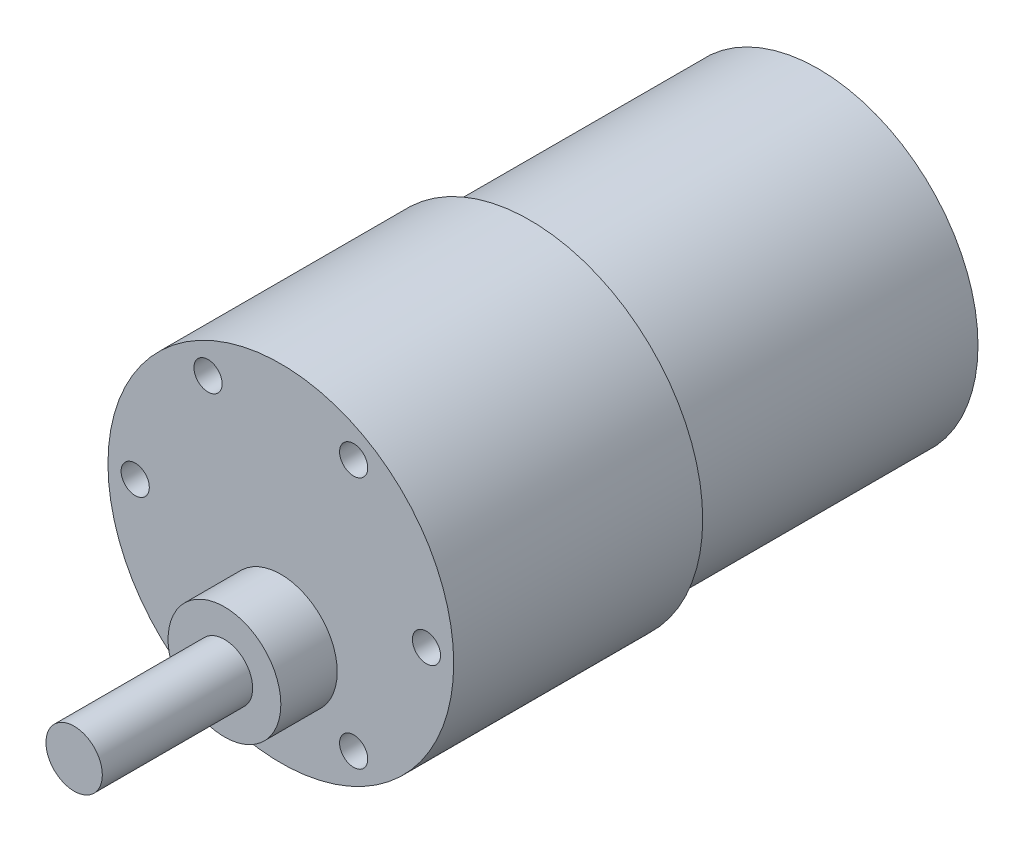
ISO-10303-21;
HEADER;
FILE_DESCRIPTION(('STEP AP214'),'2;1');
FILE_NAME('part.step','',(''),(''),'','','');
FILE_SCHEMA(('AUTOMOTIVE_DESIGN { 1 0 10303 214 1 1 1 1 }'));
ENDSEC;
DATA;
#1=APPLICATION_CONTEXT('core data for automotive mechanical design processes');
#2=APPLICATION_PROTOCOL_DEFINITION('international standard','automotive_design',2000,#1);
#3=PRODUCT_CONTEXT('',#1,'mechanical');
#4=PRODUCT('Part','Part','',(#3));
#5=PRODUCT_RELATED_PRODUCT_CATEGORY('part','',(#4));
#6=PRODUCT_DEFINITION_FORMATION('','',#4);
#7=PRODUCT_DEFINITION_CONTEXT('part definition',#1,'design');
#8=PRODUCT_DEFINITION('design','',#6,#7);
#9=PRODUCT_DEFINITION_SHAPE('','',#8);
#10=(LENGTH_UNIT() NAMED_UNIT(*) SI_UNIT(.MILLI.,.METRE.));
#11=(NAMED_UNIT(*) PLANE_ANGLE_UNIT() SI_UNIT($,.RADIAN.));
#12=(NAMED_UNIT(*) SI_UNIT($,.STERADIAN.) SOLID_ANGLE_UNIT());
#13=UNCERTAINTY_MEASURE_WITH_UNIT(LENGTH_MEASURE(1.E-05),#10,'distance_accuracy_value','');
#14=(GEOMETRIC_REPRESENTATION_CONTEXT(3) GLOBAL_UNCERTAINTY_ASSIGNED_CONTEXT((#13)) GLOBAL_UNIT_ASSIGNED_CONTEXT((#10,
#11,#12)) REPRESENTATION_CONTEXT('',''));
#15=CARTESIAN_POINT('',(0.,0.,0.));
#16=DIRECTION('',(0.,0.,1.));
#17=DIRECTION('',(1.,0.,0.));
#18=AXIS2_PLACEMENT_3D('',#15,#16,#17);
#19=CARTESIAN_POINT('',(0.,0.,26.5));
#20=DIRECTION('',(0.,0.,-1.));
#21=DIRECTION('',(-1.,0.,0.));
#22=AXIS2_PLACEMENT_3D('',#19,#20,#21);
#23=CYLINDRICAL_SURFACE('',#22,18.4);
#24=CARTESIAN_POINT('',(0.,0.,26.5));
#25=DIRECTION('',(0.,0.,1.));
#26=DIRECTION('',(1.,0.,0.));
#27=AXIS2_PLACEMENT_3D('',#24,#25,#26);
#28=CIRCLE('',#27,18.4);
#29=CARTESIAN_POINT('',(18.4,0.,26.5));
#30=VERTEX_POINT('',#29);
#31=EDGE_CURVE('E36',#30,#30,#28,.T.);
#32=ORIENTED_EDGE('',*,*,#31,.F.);
#33=EDGE_LOOP('',(#32));
#34=FACE_BOUND('',#33,.T.);
#35=CARTESIAN_POINT('',(0.,0.,0.));
#36=DIRECTION('',(0.,0.,1.));
#37=DIRECTION('',(1.,0.,0.));
#38=AXIS2_PLACEMENT_3D('',#35,#36,#37);
#39=CIRCLE('',#38,18.4);
#40=CARTESIAN_POINT('',(18.4,0.,0.));
#41=VERTEX_POINT('',#40);
#42=EDGE_CURVE('E40',#41,#41,#39,.T.);
#43=ORIENTED_EDGE('',*,*,#42,.T.);
#44=EDGE_LOOP('',(#43));
#45=FACE_BOUND('',#44,.T.);
#46=ADVANCED_FACE('F30',(#34,#45),#23,.T.);
#47=CARTESIAN_POINT('',(0.,0.,26.5));
#48=DIRECTION('',(0.,0.,1.));
#49=DIRECTION('',(1.,0.,0.));
#50=AXIS2_PLACEMENT_3D('',#47,#48,#49);
#51=PLANE('',#50);
#52=CARTESIAN_POINT('',(0.,-7.,26.5));
#53=DIRECTION('',(0.,0.,1.));
#54=DIRECTION('',(1.,0.,0.));
#55=AXIS2_PLACEMENT_3D('',#52,#53,#54);
#56=CIRCLE('',#55,6.);
#57=CARTESIAN_POINT('',(6.,-7.,26.5));
#58=VERTEX_POINT('',#57);
#59=EDGE_CURVE('E86',#58,#58,#56,.T.);
#60=ORIENTED_EDGE('',*,*,#59,.F.);
#61=EDGE_LOOP('',(#60));
#62=FACE_BOUND('',#61,.T.);
#63=CARTESIAN_POINT('',(-7.75,13.4233937586588,26.5));
#64=DIRECTION('',(0.,0.,1.));
#65=DIRECTION('',(1.,0.,0.));
#66=AXIS2_PLACEMENT_3D('',#63,#64,#65);
#67=CIRCLE('',#66,1.5);
#68=CARTESIAN_POINT('',(-6.25,13.4233937586588,26.5));
#69=VERTEX_POINT('',#68);
#70=EDGE_CURVE('E81',#69,#69,#67,.T.);
#71=ORIENTED_EDGE('',*,*,#70,.F.);
#72=EDGE_LOOP('',(#71));
#73=FACE_BOUND('',#72,.T.);
#74=CARTESIAN_POINT('',(7.74999999999999,13.4233937586588,26.5));
#75=DIRECTION('',(0.,0.,1.));
#76=DIRECTION('',(1.,0.,0.));
#77=AXIS2_PLACEMENT_3D('',#74,#75,#76);
#78=CIRCLE('',#77,1.5);
#79=CARTESIAN_POINT('',(9.24999999999999,13.4233937586588,26.5));
#80=VERTEX_POINT('',#79);
#81=EDGE_CURVE('E75',#80,#80,#78,.T.);
#82=ORIENTED_EDGE('',*,*,#81,.F.);
#83=EDGE_LOOP('',(#82));
#84=FACE_BOUND('',#83,.T.);
#85=CARTESIAN_POINT('',(15.5,0.,26.5));
#86=DIRECTION('',(0.,0.,1.));
#87=DIRECTION('',(1.,0.,0.));
#88=AXIS2_PLACEMENT_3D('',#85,#86,#87);
#89=CIRCLE('',#88,1.5);
#90=CARTESIAN_POINT('',(17.,0.,26.5));
#91=VERTEX_POINT('',#90);
#92=EDGE_CURVE('E69',#91,#91,#89,.T.);
#93=ORIENTED_EDGE('',*,*,#92,.F.);
#94=EDGE_LOOP('',(#93));
#95=FACE_BOUND('',#94,.T.);
#96=CARTESIAN_POINT('',(7.75,-13.4233937586588,26.5));
#97=DIRECTION('',(0.,0.,1.));
#98=DIRECTION('',(1.,0.,0.));
#99=AXIS2_PLACEMENT_3D('',#96,#97,#98);
#100=CIRCLE('',#99,1.5);
#101=CARTESIAN_POINT('',(9.25,-13.4233937586588,26.5));
#102=VERTEX_POINT('',#101);
#103=EDGE_CURVE('E63',#102,#102,#100,.T.);
#104=ORIENTED_EDGE('',*,*,#103,.F.);
#105=EDGE_LOOP('',(#104));
#106=FACE_BOUND('',#105,.T.);
#107=CARTESIAN_POINT('',(-7.74999999999999,-13.4233937586588,26.5));
#108=DIRECTION('',(0.,0.,1.));
#109=DIRECTION('',(1.,0.,0.));
#110=AXIS2_PLACEMENT_3D('',#107,#108,#109);
#111=CIRCLE('',#110,1.5);
#112=CARTESIAN_POINT('',(-6.24999999999999,-13.4233937586588,26.5));
#113=VERTEX_POINT('',#112);
#114=EDGE_CURVE('E56',#113,#113,#111,.T.);
#115=ORIENTED_EDGE('',*,*,#114,.F.);
#116=EDGE_LOOP('',(#115));
#117=FACE_BOUND('',#116,.T.);
#118=CARTESIAN_POINT('',(-15.5,0.,26.5));
#119=DIRECTION('',(0.,0.,1.));
#120=DIRECTION('',(1.,0.,0.));
#121=AXIS2_PLACEMENT_3D('',#118,#119,#120);
#122=CIRCLE('',#121,1.5);
#123=CARTESIAN_POINT('',(-14.,0.,26.5));
#124=VERTEX_POINT('',#123);
#125=EDGE_CURVE('E50',#124,#124,#122,.T.);
#126=ORIENTED_EDGE('',*,*,#125,.F.);
#127=EDGE_LOOP('',(#126));
#128=FACE_BOUND('',#127,.T.);
#129=ORIENTED_EDGE('',*,*,#31,.T.);
#130=EDGE_LOOP('',(#129));
#131=FACE_BOUND('',#130,.T.);
#132=ADVANCED_FACE('F119',(#62,#73,#84,#95,#106,#117,#128,#131),#51,.T.);
#133=CARTESIAN_POINT('',(0.,0.,0.));
#134=DIRECTION('',(0.,0.,1.));
#135=DIRECTION('',(1.,0.,0.));
#136=AXIS2_PLACEMENT_3D('',#133,#134,#135);
#137=PLANE('',#136);
#138=CARTESIAN_POINT('',(0.,0.,0.));
#139=DIRECTION('',(0.,0.,1.));
#140=DIRECTION('',(1.,0.,0.));
#141=AXIS2_PLACEMENT_3D('',#138,#139,#140);
#142=CIRCLE('',#141,17.);
#143=CARTESIAN_POINT('',(17.,0.,0.));
#144=VERTEX_POINT('',#143);
#145=EDGE_CURVE('E10',#144,#144,#142,.F.);
#146=ORIENTED_EDGE('',*,*,#145,.F.);
#147=EDGE_LOOP('',(#146));
#148=FACE_BOUND('',#147,.T.);
#149=ORIENTED_EDGE('',*,*,#42,.F.);
#150=EDGE_LOOP('',(#149));
#151=FACE_BOUND('',#150,.T.);
#152=ADVANCED_FACE('F122',(#148,#151),#137,.F.);
#153=CARTESIAN_POINT('',(0.,0.,-30.7));
#154=DIRECTION('',(0.,0.,1.));
#155=DIRECTION('',(1.,0.,0.));
#156=AXIS2_PLACEMENT_3D('',#153,#154,#155);
#157=CYLINDRICAL_SURFACE('',#156,17.);
#158=CARTESIAN_POINT('',(0.,0.,-30.7));
#159=DIRECTION('',(0.,0.,-1.));
#160=DIRECTION('',(-1.,0.,0.));
#161=AXIS2_PLACEMENT_3D('',#158,#159,#160);
#162=CIRCLE('',#161,17.);
#163=CARTESIAN_POINT('',(-17.,0.,-30.7));
#164=VERTEX_POINT('',#163);
#165=EDGE_CURVE('E45',#164,#164,#162,.T.);
#166=ORIENTED_EDGE('',*,*,#165,.F.);
#167=EDGE_LOOP('',(#166));
#168=FACE_BOUND('',#167,.T.);
#169=ORIENTED_EDGE('',*,*,#145,.T.);
#170=EDGE_LOOP('',(#169));
#171=FACE_BOUND('',#170,.T.);
#172=ADVANCED_FACE('F149',(#168,#171),#157,.T.);
#173=CARTESIAN_POINT('',(0.,0.,-30.7));
#174=DIRECTION('',(0.,0.,-1.));
#175=DIRECTION('',(-1.,0.,0.));
#176=AXIS2_PLACEMENT_3D('',#173,#174,#175);
#177=PLANE('',#176);
#178=ORIENTED_EDGE('',*,*,#165,.T.);
#179=EDGE_LOOP('',(#178));
#180=FACE_BOUND('',#179,.T.);
#181=ADVANCED_FACE('F139',(#180),#177,.T.);
#182=CARTESIAN_POINT('',(-15.5,0.,21.5));
#183=DIRECTION('',(0.,0.,1.));
#184=DIRECTION('',(1.,0.,0.));
#185=AXIS2_PLACEMENT_3D('',#182,#183,#184);
#186=CYLINDRICAL_SURFACE('',#185,1.5);
#187=CARTESIAN_POINT('',(-15.5,0.,21.5));
#188=DIRECTION('',(0.,0.,1.));
#189=DIRECTION('',(1.,0.,0.));
#190=AXIS2_PLACEMENT_3D('',#187,#188,#189);
#191=CIRCLE('',#190,1.5);
#192=CARTESIAN_POINT('',(-14.,0.,21.5));
#193=VERTEX_POINT('',#192);
#194=EDGE_CURVE('E49',#193,#193,#191,.T.);
#195=ORIENTED_EDGE('',*,*,#194,.F.);
#196=EDGE_LOOP('',(#195));
#197=FACE_BOUND('',#196,.T.);
#198=ORIENTED_EDGE('',*,*,#125,.T.);
#199=EDGE_LOOP('',(#198));
#200=FACE_BOUND('',#199,.T.);
#201=ADVANCED_FACE('F136',(#197,#200),#186,.F.);
#202=CARTESIAN_POINT('',(-15.5,0.,21.5));
#203=DIRECTION('',(0.,0.,1.));
#204=DIRECTION('',(1.,0.,0.));
#205=AXIS2_PLACEMENT_3D('',#202,#203,#204);
#206=PLANE('',#205);
#207=ORIENTED_EDGE('',*,*,#194,.T.);
#208=EDGE_LOOP('',(#207));
#209=FACE_BOUND('',#208,.T.);
#210=ADVANCED_FACE('F138',(#209),#206,.T.);
#211=CARTESIAN_POINT('',(-7.74999999999999,-13.4233937586588,21.5));
#212=DIRECTION('',(0.,0.,1.));
#213=DIRECTION('',(1.,0.,0.));
#214=AXIS2_PLACEMENT_3D('',#211,#212,#213);
#215=CYLINDRICAL_SURFACE('',#214,1.5);
#216=CARTESIAN_POINT('',(-7.74999999999999,-13.4233937586588,21.5));
#217=DIRECTION('',(0.,0.,1.));
#218=DIRECTION('',(1.,0.,0.));
#219=AXIS2_PLACEMENT_3D('',#216,#217,#218);
#220=CIRCLE('',#219,1.5);
#221=CARTESIAN_POINT('',(-6.24999999999999,-13.4233937586588,21.5));
#222=VERTEX_POINT('',#221);
#223=EDGE_CURVE('E59',#222,#222,#220,.T.);
#224=ORIENTED_EDGE('',*,*,#223,.F.);
#225=EDGE_LOOP('',(#224));
#226=FACE_BOUND('',#225,.T.);
#227=ORIENTED_EDGE('',*,*,#114,.T.);
#228=EDGE_LOOP('',(#227));
#229=FACE_BOUND('',#228,.T.);
#230=ADVANCED_FACE('F146',(#226,#229),#215,.F.);
#231=CARTESIAN_POINT('',(-7.74999999999999,-13.4233937586588,21.5));
#232=DIRECTION('',(0.,0.,1.));
#233=DIRECTION('',(1.,0.,0.));
#234=AXIS2_PLACEMENT_3D('',#231,#232,#233);
#235=PLANE('',#234);
#236=ORIENTED_EDGE('',*,*,#223,.T.);
#237=EDGE_LOOP('',(#236));
#238=FACE_BOUND('',#237,.T.);
#239=ADVANCED_FACE('F193',(#238),#235,.T.);
#240=CARTESIAN_POINT('',(7.75,-13.4233937586588,21.5));
#241=DIRECTION('',(0.,0.,1.));
#242=DIRECTION('',(1.,0.,0.));
#243=AXIS2_PLACEMENT_3D('',#240,#241,#242);
#244=CYLINDRICAL_SURFACE('',#243,1.5);
#245=CARTESIAN_POINT('',(7.75,-13.4233937586588,21.5));
#246=DIRECTION('',(0.,0.,1.));
#247=DIRECTION('',(1.,0.,0.));
#248=AXIS2_PLACEMENT_3D('',#245,#246,#247);
#249=CIRCLE('',#248,1.5);
#250=CARTESIAN_POINT('',(9.25,-13.4233937586588,21.5));
#251=VERTEX_POINT('',#250);
#252=EDGE_CURVE('E66',#251,#251,#249,.T.);
#253=ORIENTED_EDGE('',*,*,#252,.F.);
#254=EDGE_LOOP('',(#253));
#255=FACE_BOUND('',#254,.T.);
#256=ORIENTED_EDGE('',*,*,#103,.T.);
#257=EDGE_LOOP('',(#256));
#258=FACE_BOUND('',#257,.T.);
#259=ADVANCED_FACE('F203',(#255,#258),#244,.F.);
#260=CARTESIAN_POINT('',(7.75,-13.4233937586588,21.5));
#261=DIRECTION('',(0.,0.,1.));
#262=DIRECTION('',(1.,0.,0.));
#263=AXIS2_PLACEMENT_3D('',#260,#261,#262);
#264=PLANE('',#263);
#265=ORIENTED_EDGE('',*,*,#252,.T.);
#266=EDGE_LOOP('',(#265));
#267=FACE_BOUND('',#266,.T.);
#268=ADVANCED_FACE('F213',(#267),#264,.T.);
#269=CARTESIAN_POINT('',(15.5,0.,21.5));
#270=DIRECTION('',(0.,0.,1.));
#271=DIRECTION('',(1.,0.,0.));
#272=AXIS2_PLACEMENT_3D('',#269,#270,#271);
#273=CYLINDRICAL_SURFACE('',#272,1.5);
#274=CARTESIAN_POINT('',(15.5,0.,21.5));
#275=DIRECTION('',(0.,0.,1.));
#276=DIRECTION('',(1.,0.,0.));
#277=AXIS2_PLACEMENT_3D('',#274,#275,#276);
#278=CIRCLE('',#277,1.5);
#279=CARTESIAN_POINT('',(17.,0.,21.5));
#280=VERTEX_POINT('',#279);
#281=EDGE_CURVE('E72',#280,#280,#278,.T.);
#282=ORIENTED_EDGE('',*,*,#281,.F.);
#283=EDGE_LOOP('',(#282));
#284=FACE_BOUND('',#283,.T.);
#285=ORIENTED_EDGE('',*,*,#92,.T.);
#286=EDGE_LOOP('',(#285));
#287=FACE_BOUND('',#286,.T.);
#288=ADVANCED_FACE('F223',(#284,#287),#273,.F.);
#289=CARTESIAN_POINT('',(15.5,0.,21.5));
#290=DIRECTION('',(0.,0.,1.));
#291=DIRECTION('',(1.,0.,0.));
#292=AXIS2_PLACEMENT_3D('',#289,#290,#291);
#293=PLANE('',#292);
#294=ORIENTED_EDGE('',*,*,#281,.T.);
#295=EDGE_LOOP('',(#294));
#296=FACE_BOUND('',#295,.T.);
#297=ADVANCED_FACE('F233',(#296),#293,.T.);
#298=CARTESIAN_POINT('',(7.74999999999999,13.4233937586588,21.5));
#299=DIRECTION('',(0.,0.,1.));
#300=DIRECTION('',(1.,0.,0.));
#301=AXIS2_PLACEMENT_3D('',#298,#299,#300);
#302=CYLINDRICAL_SURFACE('',#301,1.5);
#303=CARTESIAN_POINT('',(7.74999999999999,13.4233937586588,21.5));
#304=DIRECTION('',(0.,0.,1.));
#305=DIRECTION('',(1.,0.,0.));
#306=AXIS2_PLACEMENT_3D('',#303,#304,#305);
#307=CIRCLE('',#306,1.5);
#308=CARTESIAN_POINT('',(9.24999999999999,13.4233937586588,21.5));
#309=VERTEX_POINT('',#308);
#310=EDGE_CURVE('E78',#309,#309,#307,.T.);
#311=ORIENTED_EDGE('',*,*,#310,.F.);
#312=EDGE_LOOP('',(#311));
#313=FACE_BOUND('',#312,.T.);
#314=ORIENTED_EDGE('',*,*,#81,.T.);
#315=EDGE_LOOP('',(#314));
#316=FACE_BOUND('',#315,.T.);
#317=ADVANCED_FACE('F243',(#313,#316),#302,.F.);
#318=CARTESIAN_POINT('',(7.74999999999999,13.4233937586588,21.5));
#319=DIRECTION('',(0.,0.,1.));
#320=DIRECTION('',(1.,0.,0.));
#321=AXIS2_PLACEMENT_3D('',#318,#319,#320);
#322=PLANE('',#321);
#323=ORIENTED_EDGE('',*,*,#310,.T.);
#324=EDGE_LOOP('',(#323));
#325=FACE_BOUND('',#324,.T.);
#326=ADVANCED_FACE('F253',(#325),#322,.T.);
#327=CARTESIAN_POINT('',(-7.75,13.4233937586588,21.5));
#328=DIRECTION('',(0.,0.,1.));
#329=DIRECTION('',(1.,0.,0.));
#330=AXIS2_PLACEMENT_3D('',#327,#328,#329);
#331=CYLINDRICAL_SURFACE('',#330,1.5);
#332=CARTESIAN_POINT('',(-7.75,13.4233937586588,21.5));
#333=DIRECTION('',(0.,0.,1.));
#334=DIRECTION('',(1.,0.,0.));
#335=AXIS2_PLACEMENT_3D('',#332,#333,#334);
#336=CIRCLE('',#335,1.5);
#337=CARTESIAN_POINT('',(-6.25,13.4233937586588,21.5));
#338=VERTEX_POINT('',#337);
#339=EDGE_CURVE('E53',#338,#338,#336,.T.);
#340=ORIENTED_EDGE('',*,*,#339,.F.);
#341=EDGE_LOOP('',(#340));
#342=FACE_BOUND('',#341,.T.);
#343=ORIENTED_EDGE('',*,*,#70,.T.);
#344=EDGE_LOOP('',(#343));
#345=FACE_BOUND('',#344,.T.);
#346=ADVANCED_FACE('F263',(#342,#345),#331,.F.);
#347=CARTESIAN_POINT('',(-7.75,13.4233937586588,21.5));
#348=DIRECTION('',(0.,0.,1.));
#349=DIRECTION('',(1.,0.,0.));
#350=AXIS2_PLACEMENT_3D('',#347,#348,#349);
#351=PLANE('',#350);
#352=ORIENTED_EDGE('',*,*,#339,.T.);
#353=EDGE_LOOP('',(#352));
#354=FACE_BOUND('',#353,.T.);
#355=ADVANCED_FACE('F115',(#354),#351,.T.);
#356=CARTESIAN_POINT('',(0.,-7.,32.5));
#357=DIRECTION('',(0.,0.,-1.));
#358=DIRECTION('',(-1.,0.,0.));
#359=AXIS2_PLACEMENT_3D('',#356,#357,#358);
#360=CYLINDRICAL_SURFACE('',#359,6.);
#361=CARTESIAN_POINT('',(0.,-7.,32.5));
#362=DIRECTION('',(0.,0.,1.));
#363=DIRECTION('',(1.,0.,0.));
#364=AXIS2_PLACEMENT_3D('',#361,#362,#363);
#365=CIRCLE('',#364,6.);
#366=CARTESIAN_POINT('',(6.,-7.,32.5));
#367=VERTEX_POINT('',#366);
#368=EDGE_CURVE('E60',#367,#367,#365,.T.);
#369=ORIENTED_EDGE('',*,*,#368,.F.);
#370=EDGE_LOOP('',(#369));
#371=FACE_BOUND('',#370,.T.);
#372=ORIENTED_EDGE('',*,*,#59,.T.);
#373=EDGE_LOOP('',(#372));
#374=FACE_BOUND('',#373,.T.);
#375=ADVANCED_FACE('F109',(#371,#374),#360,.T.);
#376=CARTESIAN_POINT('',(0.,-7.,32.5));
#377=DIRECTION('',(0.,0.,1.));
#378=DIRECTION('',(1.,0.,0.));
#379=AXIS2_PLACEMENT_3D('',#376,#377,#378);
#380=PLANE('',#379);
#381=CARTESIAN_POINT('',(0.,-7.,32.5));
#382=DIRECTION('',(0.,0.,1.));
#383=DIRECTION('',(1.,0.,0.));
#384=AXIS2_PLACEMENT_3D('',#381,#382,#383);
#385=CIRCLE('',#384,3.);
#386=CARTESIAN_POINT('',(3.,-7.,32.5));
#387=VERTEX_POINT('',#386);
#388=EDGE_CURVE('E92',#387,#387,#385,.T.);
#389=ORIENTED_EDGE('',*,*,#388,.F.);
#390=EDGE_LOOP('',(#389));
#391=FACE_BOUND('',#390,.T.);
#392=ORIENTED_EDGE('',*,*,#368,.T.);
#393=EDGE_LOOP('',(#392));
#394=FACE_BOUND('',#393,.T.);
#395=ADVANCED_FACE('F103',(#391,#394),#380,.T.);
#396=CARTESIAN_POINT('',(0.,-7.,48.5));
#397=DIRECTION('',(0.,0.,-1.));
#398=DIRECTION('',(-1.,0.,0.));
#399=AXIS2_PLACEMENT_3D('',#396,#397,#398);
#400=CYLINDRICAL_SURFACE('',#399,3.);
#401=CARTESIAN_POINT('',(0.,-7.,48.5));
#402=DIRECTION('',(0.,0.,1.));
#403=DIRECTION('',(1.,0.,0.));
#404=AXIS2_PLACEMENT_3D('',#401,#402,#403);
#405=CIRCLE('',#404,3.);
#406=CARTESIAN_POINT('',(3.,-7.,48.5));
#407=VERTEX_POINT('',#406);
#408=EDGE_CURVE('E89',#407,#407,#405,.T.);
#409=ORIENTED_EDGE('',*,*,#408,.F.);
#410=EDGE_LOOP('',(#409));
#411=FACE_BOUND('',#410,.T.);
#412=ORIENTED_EDGE('',*,*,#388,.T.);
#413=EDGE_LOOP('',(#412));
#414=FACE_BOUND('',#413,.T.);
#415=ADVANCED_FACE('F100',(#411,#414),#400,.T.);
#416=CARTESIAN_POINT('',(0.,-7.,48.5));
#417=DIRECTION('',(0.,0.,1.));
#418=DIRECTION('',(1.,0.,0.));
#419=AXIS2_PLACEMENT_3D('',#416,#417,#418);
#420=PLANE('',#419);
#421=ORIENTED_EDGE('',*,*,#408,.T.);
#422=EDGE_LOOP('',(#421));
#423=FACE_BOUND('',#422,.T.);
#424=ADVANCED_FACE('F98',(#423),#420,.T.);
#425=CLOSED_SHELL('',(#46,#132,#152,#172,#181,#201,#210,#230,#239,#259,#268,#288,#297,#317,#326,
#346,#355,#375,#395,#415,#424));
#426=MANIFOLD_SOLID_BREP('B2',#425);
#427=ADVANCED_BREP_SHAPE_REPRESENTATION('',(#18,#426),#14);
#428=SHAPE_DEFINITION_REPRESENTATION(#9,#427);
ENDSEC;
END-ISO-10303-21;
